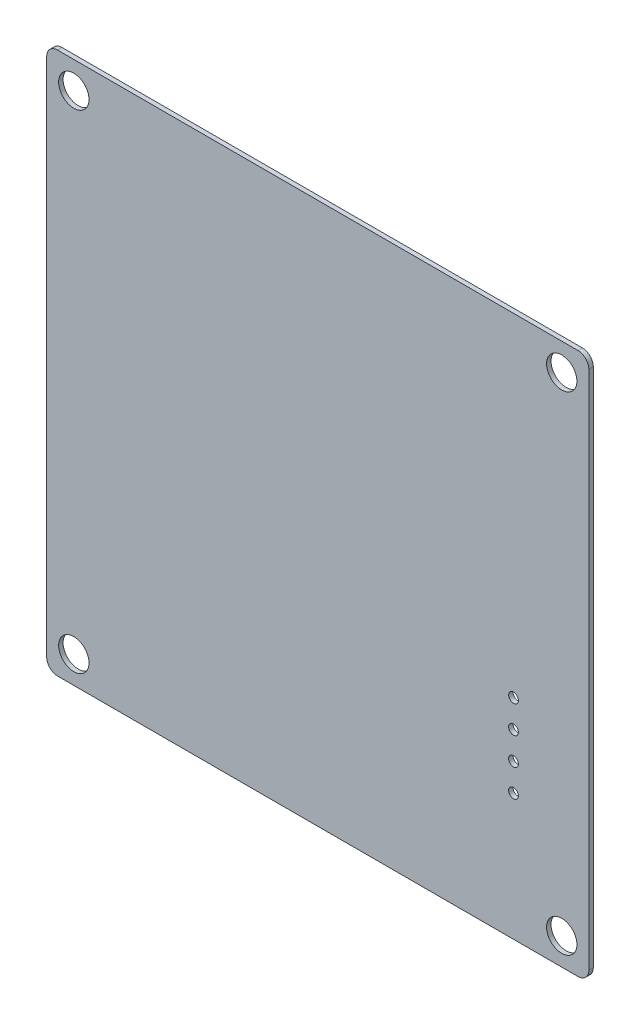
ISO-10303-21;
HEADER;
FILE_DESCRIPTION(('STEP AP214'),'2;1');
FILE_NAME('part.step','',(''),(''),'','','');
FILE_SCHEMA(('AUTOMOTIVE_DESIGN { 1 0 10303 214 1 1 1 1 }'));
ENDSEC;
DATA;
#1=APPLICATION_CONTEXT('core data for automotive mechanical design processes');
#2=APPLICATION_PROTOCOL_DEFINITION('international standard','automotive_design',2000,#1);
#3=PRODUCT_CONTEXT('',#1,'mechanical');
#4=PRODUCT('Part','Part','',(#3));
#5=PRODUCT_RELATED_PRODUCT_CATEGORY('part','',(#4));
#6=PRODUCT_DEFINITION_FORMATION('','',#4);
#7=PRODUCT_DEFINITION_CONTEXT('part definition',#1,'design');
#8=PRODUCT_DEFINITION('design','',#6,#7);
#9=PRODUCT_DEFINITION_SHAPE('','',#8);
#10=(LENGTH_UNIT() NAMED_UNIT(*) SI_UNIT(.MILLI.,.METRE.));
#11=(NAMED_UNIT(*) PLANE_ANGLE_UNIT() SI_UNIT($,.RADIAN.));
#12=(NAMED_UNIT(*) SI_UNIT($,.STERADIAN.) SOLID_ANGLE_UNIT());
#13=UNCERTAINTY_MEASURE_WITH_UNIT(LENGTH_MEASURE(1.E-05),#10,'distance_accuracy_value','');
#14=(GEOMETRIC_REPRESENTATION_CONTEXT(3) GLOBAL_UNCERTAINTY_ASSIGNED_CONTEXT((#13)) GLOBAL_UNIT_ASSIGNED_CONTEXT((#10,
#11,#12)) REPRESENTATION_CONTEXT('',''));
#15=CARTESIAN_POINT('',(0.,0.,0.));
#16=DIRECTION('',(0.,0.,1.));
#17=DIRECTION('',(1.,0.,0.));
#18=AXIS2_PLACEMENT_3D('',#15,#16,#17);
#19=CARTESIAN_POINT('',(66.675003051758,61.325000762939,0.41148));
#20=DIRECTION('',(0.,0.,-1.));
#21=DIRECTION('',(-1.,0.,0.));
#22=AXIS2_PLACEMENT_3D('',#19,#20,#21);
#23=PLANE('',#22);
#24=CARTESIAN_POINT('',(114.17499898,107.82499898,0.41148));
#25=DIRECTION('',(0.,0.,-1.));
#26=DIRECTION('',(-1.,0.,0.));
#27=AXIS2_PLACEMENT_3D('',#24,#25,#26);
#28=CIRCLE('',#27,1.39999974);
#29=CARTESIAN_POINT('',(112.77499924,107.82499898,0.41148));
#30=VERTEX_POINT('',#29);
#31=EDGE_CURVE('E150',#30,#30,#28,.T.);
#32=ORIENTED_EDGE('',*,*,#31,.T.);
#33=EDGE_LOOP('',(#32));
#34=FACE_BOUND('',#33,.T.);
#35=CARTESIAN_POINT('',(109.728,77.08000078,0.41148));
#36=DIRECTION('',(0.,0.,-1.));
#37=DIRECTION('',(-1.,0.,0.));
#38=AXIS2_PLACEMENT_3D('',#35,#36,#37);
#39=CIRCLE('',#38,0.4499991);
#40=CARTESIAN_POINT('',(109.2780009,77.08000078,0.41148));
#41=VERTEX_POINT('',#40);
#42=EDGE_CURVE('E153',#41,#41,#39,.T.);
#43=ORIENTED_EDGE('',*,*,#42,.T.);
#44=EDGE_LOOP('',(#43));
#45=FACE_BOUND('',#44,.T.);
#46=CARTESIAN_POINT('',(114.17499898,62.82500008,0.41148));
#47=DIRECTION('',(0.,0.,-1.));
#48=DIRECTION('',(-1.,0.,0.));
#49=AXIS2_PLACEMENT_3D('',#46,#47,#48);
#50=CIRCLE('',#49,1.39999974);
#51=CARTESIAN_POINT('',(112.77499924,62.82500008,0.41148));
#52=VERTEX_POINT('',#51);
#53=EDGE_CURVE('E156',#52,#52,#50,.T.);
#54=ORIENTED_EDGE('',*,*,#53,.T.);
#55=EDGE_LOOP('',(#54));
#56=FACE_BOUND('',#55,.T.);
#57=CARTESIAN_POINT('',(109.728,74.54000078,0.41148));
#58=DIRECTION('',(0.,0.,-1.));
#59=DIRECTION('',(-1.,0.,0.));
#60=AXIS2_PLACEMENT_3D('',#57,#58,#59);
#61=CIRCLE('',#60,0.4499991);
#62=CARTESIAN_POINT('',(109.2780009,74.54000078,0.41148));
#63=VERTEX_POINT('',#62);
#64=EDGE_CURVE('E159',#63,#63,#61,.T.);
#65=ORIENTED_EDGE('',*,*,#64,.T.);
#66=EDGE_LOOP('',(#65));
#67=FACE_BOUND('',#66,.T.);
#68=CARTESIAN_POINT('',(109.728,79.62000078,0.41148));
#69=DIRECTION('',(0.,0.,-1.));
#70=DIRECTION('',(-1.,0.,0.));
#71=AXIS2_PLACEMENT_3D('',#68,#69,#70);
#72=CIRCLE('',#71,0.4499991);
#73=CARTESIAN_POINT('',(109.2780009,79.62000078,0.41148));
#74=VERTEX_POINT('',#73);
#75=EDGE_CURVE('E162',#74,#74,#72,.T.);
#76=ORIENTED_EDGE('',*,*,#75,.T.);
#77=EDGE_LOOP('',(#76));
#78=FACE_BOUND('',#77,.T.);
#79=CARTESIAN_POINT('',(69.17500008,107.82499898,0.41148));
#80=DIRECTION('',(0.,0.,-1.));
#81=DIRECTION('',(-1.,0.,0.));
#82=AXIS2_PLACEMENT_3D('',#79,#80,#81);
#83=CIRCLE('',#82,1.39999974);
#84=CARTESIAN_POINT('',(67.77500034,107.82499898,0.41148));
#85=VERTEX_POINT('',#84);
#86=EDGE_CURVE('E165',#85,#85,#83,.T.);
#87=ORIENTED_EDGE('',*,*,#86,.T.);
#88=EDGE_LOOP('',(#87));
#89=FACE_BOUND('',#88,.T.);
#90=CARTESIAN_POINT('',(109.728,72.00000078,0.41148));
#91=DIRECTION('',(0.,0.,-1.));
#92=DIRECTION('',(-1.,0.,0.));
#93=AXIS2_PLACEMENT_3D('',#90,#91,#92);
#94=CIRCLE('',#93,0.4499991);
#95=CARTESIAN_POINT('',(109.2780009,72.00000078,0.41148));
#96=VERTEX_POINT('',#95);
#97=EDGE_CURVE('E168',#96,#96,#94,.T.);
#98=ORIENTED_EDGE('',*,*,#97,.T.);
#99=EDGE_LOOP('',(#98));
#100=FACE_BOUND('',#99,.T.);
#101=CARTESIAN_POINT('',(69.17500008,62.82500008,0.41148));
#102=DIRECTION('',(0.,0.,-1.));
#103=DIRECTION('',(-1.,0.,0.));
#104=AXIS2_PLACEMENT_3D('',#101,#102,#103);
#105=CIRCLE('',#104,1.39999974);
#106=CARTESIAN_POINT('',(67.77500034,62.82500008,0.41148));
#107=VERTEX_POINT('',#106);
#108=EDGE_CURVE('E171',#107,#107,#105,.T.);
#109=ORIENTED_EDGE('',*,*,#108,.T.);
#110=EDGE_LOOP('',(#109));
#111=FACE_BOUND('',#110,.T.);
#112=DIRECTION('',(1.,0.,0.));
#113=VECTOR('',#112,1.);
#114=CARTESIAN_POINT('',(67.675003051758,60.325000762939,0.41148));
#115=LINE('',#114,#113);
#116=CARTESIAN_POINT('',(67.675003051758,60.325000762939,0.41148));
#117=VERTEX_POINT('',#116);
#118=CARTESIAN_POINT('',(115.67500305175,60.325000762939,0.41148));
#119=VERTEX_POINT('',#118);
#120=EDGE_CURVE('E109',#117,#119,#115,.T.);
#121=ORIENTED_EDGE('',*,*,#120,.T.);
#122=CARTESIAN_POINT('',(115.67464082029,61.325362994399,0.41148));
#123=DIRECTION('',(0.,0.,-1.));
#124=DIRECTION('',(-1.,0.,0.));
#125=AXIS2_PLACEMENT_3D('',#122,#123,#124);
#126=CIRCLE('',#125,1.000362297042);
#127=CARTESIAN_POINT('',(116.67500305175,61.325000762939,0.41148));
#128=VERTEX_POINT('',#127);
#129=EDGE_CURVE('E112',#128,#119,#126,.T.);
#130=ORIENTED_EDGE('',*,*,#129,.F.);
#131=DIRECTION('',(0.,1.,0.));
#132=VECTOR('',#131,1.);
#133=CARTESIAN_POINT('',(116.67500305175,61.325000762939,0.41148));
#134=LINE('',#133,#132);
#135=CARTESIAN_POINT('',(116.67500305175,109.32499694824,0.41148));
#136=VERTEX_POINT('',#135);
#137=EDGE_CURVE('E113',#128,#136,#134,.T.);
#138=ORIENTED_EDGE('',*,*,#137,.T.);
#139=CARTESIAN_POINT('',(115.67464082029,109.32463471678,0.41148));
#140=DIRECTION('',(0.,0.,-1.));
#141=DIRECTION('',(-1.,0.,0.));
#142=AXIS2_PLACEMENT_3D('',#139,#140,#141);
#143=CIRCLE('',#142,1.000362297042);
#144=CARTESIAN_POINT('',(115.67500305175,110.32499694824,0.41148));
#145=VERTEX_POINT('',#144);
#146=EDGE_CURVE('E87',#145,#136,#143,.T.);
#147=ORIENTED_EDGE('',*,*,#146,.F.);
#148=DIRECTION('',(1.,0.,0.));
#149=VECTOR('',#148,1.);
#150=CARTESIAN_POINT('',(115.67500305175,110.32499694824,0.41148));
#151=LINE('',#150,#149);
#152=CARTESIAN_POINT('',(67.675003051758,110.32499694824,0.41148));
#153=VERTEX_POINT('',#152);
#154=EDGE_CURVE('E83',#145,#153,#151,.F.);
#155=ORIENTED_EDGE('',*,*,#154,.T.);
#156=CARTESIAN_POINT('',(67.675365283218,109.32463471678,0.41148));
#157=DIRECTION('',(0.,0.,-1.));
#158=DIRECTION('',(-1.,0.,0.));
#159=AXIS2_PLACEMENT_3D('',#156,#157,#158);
#160=CIRCLE('',#159,1.000362297042);
#161=CARTESIAN_POINT('',(66.675003051758,109.32499694824,0.41148));
#162=VERTEX_POINT('',#161);
#163=EDGE_CURVE('E20',#162,#153,#160,.T.);
#164=ORIENTED_EDGE('',*,*,#163,.F.);
#165=DIRECTION('',(0.,1.,0.));
#166=VECTOR('',#165,1.);
#167=CARTESIAN_POINT('',(66.675003051758,109.32499694824,0.41148));
#168=LINE('',#167,#166);
#169=CARTESIAN_POINT('',(66.675003051758,61.325000762939,0.41148));
#170=VERTEX_POINT('',#169);
#171=EDGE_CURVE('E78',#162,#170,#168,.F.);
#172=ORIENTED_EDGE('',*,*,#171,.T.);
#173=CARTESIAN_POINT('',(67.675365283218,61.325362994399,0.41148));
#174=DIRECTION('',(0.,0.,-1.));
#175=DIRECTION('',(-1.,0.,0.));
#176=AXIS2_PLACEMENT_3D('',#173,#174,#175);
#177=CIRCLE('',#176,1.000362297042);
#178=EDGE_CURVE('E175',#117,#170,#177,.T.);
#179=ORIENTED_EDGE('',*,*,#178,.F.);
#180=EDGE_LOOP('',(#121,#130,#138,#147,#155,#164,#172,#179));
#181=FACE_BOUND('',#180,.T.);
#182=ADVANCED_FACE('F17',(#34,#45,#56,#67,#78,#89,#100,#111,#181),#23,.F.);
#183=CARTESIAN_POINT('',(66.675003051758,109.32499694824,0.));
#184=DIRECTION('',(1.,0.,0.));
#185=DIRECTION('',(0.,0.,-1.));
#186=AXIS2_PLACEMENT_3D('',#183,#184,#185);
#187=PLANE('',#186);
#188=DIRECTION('',(0.,0.,-1.));
#189=VECTOR('',#188,1.);
#190=CARTESIAN_POINT('',(66.6750030517581,61.325000762939,0.));
#191=LINE('',#190,#189);
#192=CARTESIAN_POINT('',(66.675003051758,61.325000762939,0.));
#193=VERTEX_POINT('',#192);
#194=EDGE_CURVE('E174',#170,#193,#191,.T.);
#195=ORIENTED_EDGE('',*,*,#194,.F.);
#196=ORIENTED_EDGE('',*,*,#171,.F.);
#197=DIRECTION('',(0.,0.,-1.));
#198=VECTOR('',#197,1.);
#199=CARTESIAN_POINT('',(66.6750030517581,109.32499694824,0.));
#200=LINE('',#199,#198);
#201=CARTESIAN_POINT('',(66.6750030517581,109.32499694824,0.));
#202=VERTEX_POINT('',#201);
#203=EDGE_CURVE('E97',#202,#162,#200,.F.);
#204=ORIENTED_EDGE('',*,*,#203,.F.);
#205=DIRECTION('',(0.,1.,0.));
#206=VECTOR('',#205,1.);
#207=CARTESIAN_POINT('',(66.675003051758,61.325000762939,0.));
#208=LINE('',#207,#206);
#209=EDGE_CURVE('E149',#193,#202,#208,.T.);
#210=ORIENTED_EDGE('',*,*,#209,.F.);
#211=EDGE_LOOP('',(#195,#196,#204,#210));
#212=FACE_BOUND('',#211,.T.);
#213=ADVANCED_FACE('F211',(#212),#187,.F.);
#214=CARTESIAN_POINT('',(67.675365283218,109.32463471678,0.));
#215=DIRECTION('',(0.,0.,-1.));
#216=DIRECTION('',(-1.,0.,0.));
#217=AXIS2_PLACEMENT_3D('',#214,#215,#216);
#218=CYLINDRICAL_SURFACE('',#217,1.000362297042);
#219=ORIENTED_EDGE('',*,*,#163,.T.);
#220=DIRECTION('',(0.,0.,-1.));
#221=VECTOR('',#220,1.);
#222=CARTESIAN_POINT('',(67.675003051758,110.32499694824,0.));
#223=LINE('',#222,#221);
#224=CARTESIAN_POINT('',(67.675003051758,110.32499694824,0.));
#225=VERTEX_POINT('',#224);
#226=EDGE_CURVE('E91',#153,#225,#223,.T.);
#227=ORIENTED_EDGE('',*,*,#226,.T.);
#228=CARTESIAN_POINT('',(67.675365283218,109.32463471678,0.));
#229=DIRECTION('',(0.,0.,-1.));
#230=DIRECTION('',(-1.,0.,0.));
#231=AXIS2_PLACEMENT_3D('',#228,#229,#230);
#232=CIRCLE('',#231,1.000362297042);
#233=EDGE_CURVE('E147',#202,#225,#232,.T.);
#234=ORIENTED_EDGE('',*,*,#233,.F.);
#235=ORIENTED_EDGE('',*,*,#203,.T.);
#236=EDGE_LOOP('',(#219,#227,#234,#235));
#237=FACE_BOUND('',#236,.T.);
#238=ADVANCED_FACE('F94',(#237),#218,.T.);
#239=CARTESIAN_POINT('',(115.67500305175,110.32499694824,0.));
#240=DIRECTION('',(0.,-1.,0.));
#241=DIRECTION('',(0.,0.,-1.));
#242=AXIS2_PLACEMENT_3D('',#239,#240,#241);
#243=PLANE('',#242);
#244=ORIENTED_EDGE('',*,*,#226,.F.);
#245=ORIENTED_EDGE('',*,*,#154,.F.);
#246=DIRECTION('',(0.,0.,-1.));
#247=VECTOR('',#246,1.);
#248=CARTESIAN_POINT('',(115.67500305175,110.32499694824,0.));
#249=LINE('',#248,#247);
#250=CARTESIAN_POINT('',(115.67500305175,110.32499694824,0.));
#251=VERTEX_POINT('',#250);
#252=EDGE_CURVE('E102',#251,#145,#249,.F.);
#253=ORIENTED_EDGE('',*,*,#252,.F.);
#254=DIRECTION('',(-1.,0.,0.));
#255=VECTOR('',#254,1.);
#256=CARTESIAN_POINT('',(66.675003051758,110.32499694824,0.));
#257=LINE('',#256,#255);
#258=EDGE_CURVE('E100',#225,#251,#257,.F.);
#259=ORIENTED_EDGE('',*,*,#258,.F.);
#260=EDGE_LOOP('',(#244,#245,#253,#259));
#261=FACE_BOUND('',#260,.T.);
#262=ADVANCED_FACE('F98',(#261),#243,.F.);
#263=CARTESIAN_POINT('',(115.67464082029,109.32463471678,0.));
#264=DIRECTION('',(0.,0.,-1.));
#265=DIRECTION('',(-1.,0.,0.));
#266=AXIS2_PLACEMENT_3D('',#263,#264,#265);
#267=CYLINDRICAL_SURFACE('',#266,1.000362297042);
#268=ORIENTED_EDGE('',*,*,#146,.T.);
#269=DIRECTION('',(0.,0.,1.));
#270=VECTOR('',#269,1.);
#271=CARTESIAN_POINT('',(116.67500305175,109.32499694824,0.));
#272=LINE('',#271,#270);
#273=CARTESIAN_POINT('',(116.67500305175,109.32499694824,0.));
#274=VERTEX_POINT('',#273);
#275=EDGE_CURVE('E114',#136,#274,#272,.F.);
#276=ORIENTED_EDGE('',*,*,#275,.T.);
#277=CARTESIAN_POINT('',(115.67464082029,109.32463471678,0.));
#278=DIRECTION('',(0.,0.,-1.));
#279=DIRECTION('',(-1.,0.,0.));
#280=AXIS2_PLACEMENT_3D('',#277,#278,#279);
#281=CIRCLE('',#280,1.000362297042);
#282=EDGE_CURVE('E144',#251,#274,#281,.T.);
#283=ORIENTED_EDGE('',*,*,#282,.F.);
#284=ORIENTED_EDGE('',*,*,#252,.T.);
#285=EDGE_LOOP('',(#268,#276,#283,#284));
#286=FACE_BOUND('',#285,.T.);
#287=ADVANCED_FACE('F182',(#286),#267,.T.);
#288=CARTESIAN_POINT('',(116.67500305175,61.325000762939,0.));
#289=DIRECTION('',(-1.,0.,0.));
#290=DIRECTION('',(0.,0.,1.));
#291=AXIS2_PLACEMENT_3D('',#288,#289,#290);
#292=PLANE('',#291);
#293=ORIENTED_EDGE('',*,*,#275,.F.);
#294=ORIENTED_EDGE('',*,*,#137,.F.);
#295=DIRECTION('',(0.,0.,-1.));
#296=VECTOR('',#295,1.);
#297=CARTESIAN_POINT('',(116.67500305175,61.325000762939,0.));
#298=LINE('',#297,#296);
#299=CARTESIAN_POINT('',(116.67500305175,61.325000762939,0.));
#300=VERTEX_POINT('',#299);
#301=EDGE_CURVE('E179',#300,#128,#298,.F.);
#302=ORIENTED_EDGE('',*,*,#301,.F.);
#303=DIRECTION('',(0.,1.,0.));
#304=VECTOR('',#303,1.);
#305=CARTESIAN_POINT('',(116.67500305175,61.325000762939,0.));
#306=LINE('',#305,#304);
#307=EDGE_CURVE('E143',#274,#300,#306,.F.);
#308=ORIENTED_EDGE('',*,*,#307,.F.);
#309=EDGE_LOOP('',(#293,#294,#302,#308));
#310=FACE_BOUND('',#309,.T.);
#311=ADVANCED_FACE('F186',(#310),#292,.F.);
#312=CARTESIAN_POINT('',(115.67464082029,61.325362994399,0.));
#313=DIRECTION('',(0.,0.,-1.));
#314=DIRECTION('',(-1.,0.,0.));
#315=AXIS2_PLACEMENT_3D('',#312,#313,#314);
#316=CYLINDRICAL_SURFACE('',#315,1.000362297042);
#317=ORIENTED_EDGE('',*,*,#129,.T.);
#318=DIRECTION('',(0.,0.,1.));
#319=VECTOR('',#318,1.);
#320=CARTESIAN_POINT('',(115.67500305175,60.325000762939,0.));
#321=LINE('',#320,#319);
#322=CARTESIAN_POINT('',(115.67500305175,60.325000762939,0.));
#323=VERTEX_POINT('',#322);
#324=EDGE_CURVE('E111',#119,#323,#321,.F.);
#325=ORIENTED_EDGE('',*,*,#324,.T.);
#326=CARTESIAN_POINT('',(115.67464082029,61.325362994399,0.));
#327=DIRECTION('',(0.,0.,-1.));
#328=DIRECTION('',(-1.,0.,0.));
#329=AXIS2_PLACEMENT_3D('',#326,#327,#328);
#330=CIRCLE('',#329,1.000362297042);
#331=EDGE_CURVE('E140',#300,#323,#330,.T.);
#332=ORIENTED_EDGE('',*,*,#331,.F.);
#333=ORIENTED_EDGE('',*,*,#301,.T.);
#334=EDGE_LOOP('',(#317,#325,#332,#333));
#335=FACE_BOUND('',#334,.T.);
#336=ADVANCED_FACE('F208',(#335),#316,.T.);
#337=CARTESIAN_POINT('',(67.675003051758,60.325000762939,0.));
#338=DIRECTION('',(0.,1.,0.));
#339=DIRECTION('',(0.,0.,1.));
#340=AXIS2_PLACEMENT_3D('',#337,#338,#339);
#341=PLANE('',#340);
#342=ORIENTED_EDGE('',*,*,#324,.F.);
#343=ORIENTED_EDGE('',*,*,#120,.F.);
#344=DIRECTION('',(0.,0.,-1.));
#345=VECTOR('',#344,1.);
#346=CARTESIAN_POINT('',(67.675003051758,60.3250007629391,0.));
#347=LINE('',#346,#345);
#348=CARTESIAN_POINT('',(67.675003051758,60.325000762939,0.));
#349=VERTEX_POINT('',#348);
#350=EDGE_CURVE('E35',#349,#117,#347,.F.);
#351=ORIENTED_EDGE('',*,*,#350,.F.);
#352=DIRECTION('',(-1.,0.,0.));
#353=VECTOR('',#352,1.);
#354=CARTESIAN_POINT('',(66.675003051758,60.325000762939,0.));
#355=LINE('',#354,#353);
#356=EDGE_CURVE('E139',#323,#349,#355,.T.);
#357=ORIENTED_EDGE('',*,*,#356,.F.);
#358=EDGE_LOOP('',(#342,#343,#351,#357));
#359=FACE_BOUND('',#358,.T.);
#360=ADVANCED_FACE('F205',(#359),#341,.F.);
#361=CARTESIAN_POINT('',(67.675365283218,61.325362994399,0.));
#362=DIRECTION('',(0.,0.,-1.));
#363=DIRECTION('',(-1.,0.,0.));
#364=AXIS2_PLACEMENT_3D('',#361,#362,#363);
#365=CYLINDRICAL_SURFACE('',#364,1.000362297042);
#366=ORIENTED_EDGE('',*,*,#178,.T.);
#367=ORIENTED_EDGE('',*,*,#194,.T.);
#368=CARTESIAN_POINT('',(67.675365283218,61.325362994399,0.));
#369=DIRECTION('',(0.,0.,-1.));
#370=DIRECTION('',(-1.,0.,0.));
#371=AXIS2_PLACEMENT_3D('',#368,#369,#370);
#372=CIRCLE('',#371,1.000362297042);
#373=EDGE_CURVE('E136',#349,#193,#372,.T.);
#374=ORIENTED_EDGE('',*,*,#373,.F.);
#375=ORIENTED_EDGE('',*,*,#350,.T.);
#376=EDGE_LOOP('',(#366,#367,#374,#375));
#377=FACE_BOUND('',#376,.T.);
#378=ADVANCED_FACE('F210',(#377),#365,.T.);
#379=CARTESIAN_POINT('',(69.17500008,62.82500008,0.));
#380=DIRECTION('',(0.,0.,-1.));
#381=DIRECTION('',(-1.,0.,0.));
#382=AXIS2_PLACEMENT_3D('',#379,#380,#381);
#383=CYLINDRICAL_SURFACE('',#382,1.39999974);
#384=ORIENTED_EDGE('',*,*,#108,.F.);
#385=EDGE_LOOP('',(#384));
#386=FACE_BOUND('',#385,.T.);
#387=CARTESIAN_POINT('',(69.17500008,62.82500008,0.));
#388=DIRECTION('',(0.,0.,-1.));
#389=DIRECTION('',(-1.,0.,0.));
#390=AXIS2_PLACEMENT_3D('',#387,#388,#389);
#391=CIRCLE('',#390,1.39999974);
#392=CARTESIAN_POINT('',(67.77500034,62.82500008,0.));
#393=VERTEX_POINT('',#392);
#394=EDGE_CURVE('E133',#393,#393,#391,.F.);
#395=ORIENTED_EDGE('',*,*,#394,.F.);
#396=EDGE_LOOP('',(#395));
#397=FACE_BOUND('',#396,.T.);
#398=ADVANCED_FACE('F254',(#386,#397),#383,.F.);
#399=CARTESIAN_POINT('',(109.728,72.00000078,0.));
#400=DIRECTION('',(0.,0.,-1.));
#401=DIRECTION('',(-1.,0.,0.));
#402=AXIS2_PLACEMENT_3D('',#399,#400,#401);
#403=CYLINDRICAL_SURFACE('',#402,0.4499991);
#404=ORIENTED_EDGE('',*,*,#97,.F.);
#405=EDGE_LOOP('',(#404));
#406=FACE_BOUND('',#405,.T.);
#407=CARTESIAN_POINT('',(109.728,72.00000078,0.));
#408=DIRECTION('',(0.,0.,-1.));
#409=DIRECTION('',(-1.,0.,0.));
#410=AXIS2_PLACEMENT_3D('',#407,#408,#409);
#411=CIRCLE('',#410,0.4499991);
#412=CARTESIAN_POINT('',(109.2780009,72.00000078,0.));
#413=VERTEX_POINT('',#412);
#414=EDGE_CURVE('E130',#413,#413,#411,.F.);
#415=ORIENTED_EDGE('',*,*,#414,.F.);
#416=EDGE_LOOP('',(#415));
#417=FACE_BOUND('',#416,.T.);
#418=ADVANCED_FACE('F250',(#406,#417),#403,.F.);
#419=CARTESIAN_POINT('',(69.17500008,107.82499898,0.));
#420=DIRECTION('',(0.,0.,-1.));
#421=DIRECTION('',(-1.,0.,0.));
#422=AXIS2_PLACEMENT_3D('',#419,#420,#421);
#423=CYLINDRICAL_SURFACE('',#422,1.39999974);
#424=ORIENTED_EDGE('',*,*,#86,.F.);
#425=EDGE_LOOP('',(#424));
#426=FACE_BOUND('',#425,.T.);
#427=CARTESIAN_POINT('',(69.17500008,107.82499898,0.));
#428=DIRECTION('',(0.,0.,-1.));
#429=DIRECTION('',(-1.,0.,0.));
#430=AXIS2_PLACEMENT_3D('',#427,#428,#429);
#431=CIRCLE('',#430,1.39999974);
#432=CARTESIAN_POINT('',(67.77500034,107.82499898,0.));
#433=VERTEX_POINT('',#432);
#434=EDGE_CURVE('E127',#433,#433,#431,.F.);
#435=ORIENTED_EDGE('',*,*,#434,.F.);
#436=EDGE_LOOP('',(#435));
#437=FACE_BOUND('',#436,.T.);
#438=ADVANCED_FACE('F246',(#426,#437),#423,.F.);
#439=CARTESIAN_POINT('',(109.728,79.62000078,0.));
#440=DIRECTION('',(0.,0.,-1.));
#441=DIRECTION('',(-1.,0.,0.));
#442=AXIS2_PLACEMENT_3D('',#439,#440,#441);
#443=CYLINDRICAL_SURFACE('',#442,0.4499991);
#444=ORIENTED_EDGE('',*,*,#75,.F.);
#445=EDGE_LOOP('',(#444));
#446=FACE_BOUND('',#445,.T.);
#447=CARTESIAN_POINT('',(109.728,79.62000078,0.));
#448=DIRECTION('',(0.,0.,-1.));
#449=DIRECTION('',(-1.,0.,0.));
#450=AXIS2_PLACEMENT_3D('',#447,#448,#449);
#451=CIRCLE('',#450,0.4499991);
#452=CARTESIAN_POINT('',(109.2780009,79.62000078,0.));
#453=VERTEX_POINT('',#452);
#454=EDGE_CURVE('E124',#453,#453,#451,.F.);
#455=ORIENTED_EDGE('',*,*,#454,.F.);
#456=EDGE_LOOP('',(#455));
#457=FACE_BOUND('',#456,.T.);
#458=ADVANCED_FACE('F242',(#446,#457),#443,.F.);
#459=CARTESIAN_POINT('',(109.728,74.54000078,0.));
#460=DIRECTION('',(0.,0.,-1.));
#461=DIRECTION('',(-1.,0.,0.));
#462=AXIS2_PLACEMENT_3D('',#459,#460,#461);
#463=CYLINDRICAL_SURFACE('',#462,0.4499991);
#464=ORIENTED_EDGE('',*,*,#64,.F.);
#465=EDGE_LOOP('',(#464));
#466=FACE_BOUND('',#465,.T.);
#467=CARTESIAN_POINT('',(109.728,74.54000078,0.));
#468=DIRECTION('',(0.,0.,-1.));
#469=DIRECTION('',(-1.,0.,0.));
#470=AXIS2_PLACEMENT_3D('',#467,#468,#469);
#471=CIRCLE('',#470,0.4499991);
#472=CARTESIAN_POINT('',(109.2780009,74.54000078,0.));
#473=VERTEX_POINT('',#472);
#474=EDGE_CURVE('E121',#473,#473,#471,.F.);
#475=ORIENTED_EDGE('',*,*,#474,.F.);
#476=EDGE_LOOP('',(#475));
#477=FACE_BOUND('',#476,.T.);
#478=ADVANCED_FACE('F238',(#466,#477),#463,.F.);
#479=CARTESIAN_POINT('',(114.17499898,62.82500008,0.));
#480=DIRECTION('',(0.,0.,-1.));
#481=DIRECTION('',(-1.,0.,0.));
#482=AXIS2_PLACEMENT_3D('',#479,#480,#481);
#483=CYLINDRICAL_SURFACE('',#482,1.39999974);
#484=ORIENTED_EDGE('',*,*,#53,.F.);
#485=EDGE_LOOP('',(#484));
#486=FACE_BOUND('',#485,.T.);
#487=CARTESIAN_POINT('',(114.17499898,62.82500008,0.));
#488=DIRECTION('',(0.,0.,-1.));
#489=DIRECTION('',(-1.,0.,0.));
#490=AXIS2_PLACEMENT_3D('',#487,#488,#489);
#491=CIRCLE('',#490,1.39999974);
#492=CARTESIAN_POINT('',(112.77499924,62.82500008,0.));
#493=VERTEX_POINT('',#492);
#494=EDGE_CURVE('E118',#493,#493,#491,.F.);
#495=ORIENTED_EDGE('',*,*,#494,.F.);
#496=EDGE_LOOP('',(#495));
#497=FACE_BOUND('',#496,.T.);
#498=ADVANCED_FACE('F234',(#486,#497),#483,.F.);
#499=CARTESIAN_POINT('',(109.728,77.08000078,0.));
#500=DIRECTION('',(0.,0.,-1.));
#501=DIRECTION('',(-1.,0.,0.));
#502=AXIS2_PLACEMENT_3D('',#499,#500,#501);
#503=CYLINDRICAL_SURFACE('',#502,0.4499991);
#504=ORIENTED_EDGE('',*,*,#42,.F.);
#505=EDGE_LOOP('',(#504));
#506=FACE_BOUND('',#505,.T.);
#507=CARTESIAN_POINT('',(109.728,77.08000078,0.));
#508=DIRECTION('',(0.,0.,-1.));
#509=DIRECTION('',(-1.,0.,0.));
#510=AXIS2_PLACEMENT_3D('',#507,#508,#509);
#511=CIRCLE('',#510,0.4499991);
#512=CARTESIAN_POINT('',(109.2780009,77.08000078,0.));
#513=VERTEX_POINT('',#512);
#514=EDGE_CURVE('E26',#513,#513,#511,.F.);
#515=ORIENTED_EDGE('',*,*,#514,.F.);
#516=EDGE_LOOP('',(#515));
#517=FACE_BOUND('',#516,.T.);
#518=ADVANCED_FACE('F227',(#506,#517),#503,.F.);
#519=CARTESIAN_POINT('',(114.17499898,107.82499898,0.));
#520=DIRECTION('',(0.,0.,-1.));
#521=DIRECTION('',(-1.,0.,0.));
#522=AXIS2_PLACEMENT_3D('',#519,#520,#521);
#523=CYLINDRICAL_SURFACE('',#522,1.39999974);
#524=ORIENTED_EDGE('',*,*,#31,.F.);
#525=EDGE_LOOP('',(#524));
#526=FACE_BOUND('',#525,.T.);
#527=CARTESIAN_POINT('',(114.17499898,107.82499898,0.));
#528=DIRECTION('',(0.,0.,-1.));
#529=DIRECTION('',(-1.,0.,0.));
#530=AXIS2_PLACEMENT_3D('',#527,#528,#529);
#531=CIRCLE('',#530,1.39999974);
#532=CARTESIAN_POINT('',(112.77499924,107.82499898,0.));
#533=VERTEX_POINT('',#532);
#534=EDGE_CURVE('E11',#533,#533,#531,.F.);
#535=ORIENTED_EDGE('',*,*,#534,.F.);
#536=EDGE_LOOP('',(#535));
#537=FACE_BOUND('',#536,.T.);
#538=ADVANCED_FACE('F221',(#526,#537),#523,.F.);
#539=CARTESIAN_POINT('',(66.675003051758,61.325000762939,0.));
#540=DIRECTION('',(0.,0.,-1.));
#541=DIRECTION('',(-1.,0.,0.));
#542=AXIS2_PLACEMENT_3D('',#539,#540,#541);
#543=PLANE('',#542);
#544=ORIENTED_EDGE('',*,*,#534,.T.);
#545=EDGE_LOOP('',(#544));
#546=FACE_BOUND('',#545,.T.);
#547=ORIENTED_EDGE('',*,*,#514,.T.);
#548=EDGE_LOOP('',(#547));
#549=FACE_BOUND('',#548,.T.);
#550=ORIENTED_EDGE('',*,*,#494,.T.);
#551=EDGE_LOOP('',(#550));
#552=FACE_BOUND('',#551,.T.);
#553=ORIENTED_EDGE('',*,*,#474,.T.);
#554=EDGE_LOOP('',(#553));
#555=FACE_BOUND('',#554,.T.);
#556=ORIENTED_EDGE('',*,*,#454,.T.);
#557=EDGE_LOOP('',(#556));
#558=FACE_BOUND('',#557,.T.);
#559=ORIENTED_EDGE('',*,*,#434,.T.);
#560=EDGE_LOOP('',(#559));
#561=FACE_BOUND('',#560,.T.);
#562=ORIENTED_EDGE('',*,*,#414,.T.);
#563=EDGE_LOOP('',(#562));
#564=FACE_BOUND('',#563,.T.);
#565=ORIENTED_EDGE('',*,*,#394,.T.);
#566=EDGE_LOOP('',(#565));
#567=FACE_BOUND('',#566,.T.);
#568=ORIENTED_EDGE('',*,*,#356,.T.);
#569=ORIENTED_EDGE('',*,*,#373,.T.);
#570=ORIENTED_EDGE('',*,*,#209,.T.);
#571=ORIENTED_EDGE('',*,*,#233,.T.);
#572=ORIENTED_EDGE('',*,*,#258,.T.);
#573=ORIENTED_EDGE('',*,*,#282,.T.);
#574=ORIENTED_EDGE('',*,*,#307,.T.);
#575=ORIENTED_EDGE('',*,*,#331,.T.);
#576=EDGE_LOOP('',(#568,#569,#570,#571,#572,#573,#574,#575));
#577=FACE_BOUND('',#576,.T.);
#578=ADVANCED_FACE('F202',(#546,#549,#552,#555,#558,#561,#564,#567,#577),#543,.T.);
#579=CLOSED_SHELL('',(#182,#213,#238,#262,#287,#311,#336,#360,#378,#398,#418,#438,#458,#478,
#498,#518,#538,#578));
#580=MANIFOLD_SOLID_BREP('B1',#579);
#581=ADVANCED_BREP_SHAPE_REPRESENTATION('',(#18,#580),#14);
#582=SHAPE_DEFINITION_REPRESENTATION(#9,#581);
ENDSEC;
END-ISO-10303-21;
